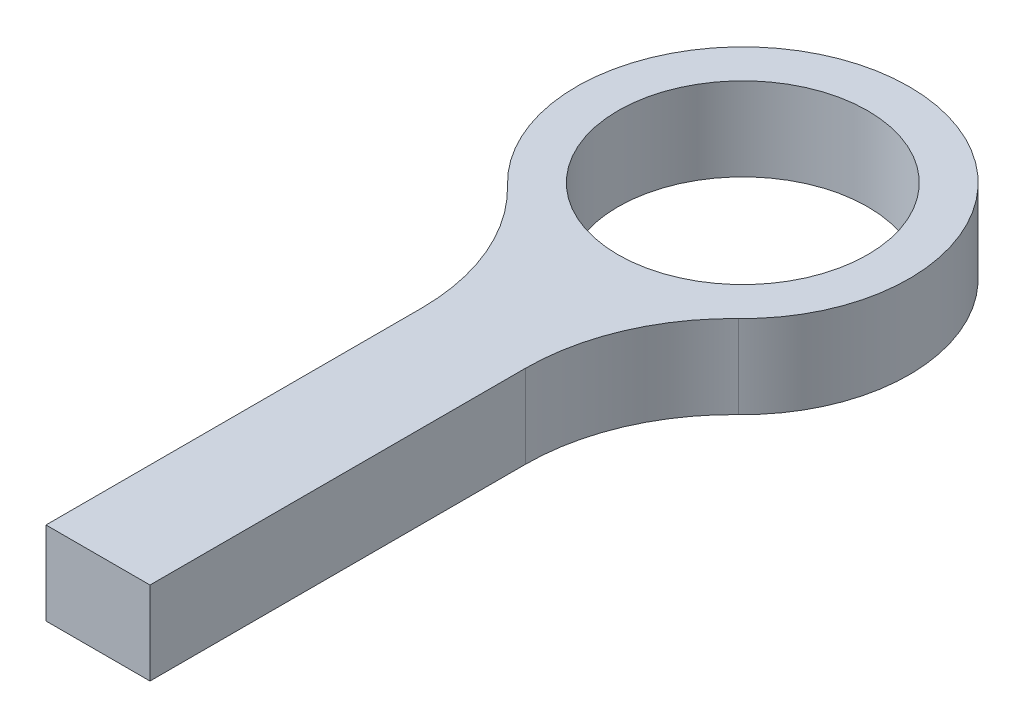
ISO-10303-21;
HEADER;
FILE_DESCRIPTION(('STEP AP214'),'2;1');
FILE_NAME('part.step','',(''),(''),'','','');
FILE_SCHEMA(('AUTOMOTIVE_DESIGN { 1 0 10303 214 1 1 1 1 }'));
ENDSEC;
DATA;
#1=APPLICATION_CONTEXT('core data for automotive mechanical design processes');
#2=APPLICATION_PROTOCOL_DEFINITION('international standard','automotive_design',2000,#1);
#3=PRODUCT_CONTEXT('',#1,'mechanical');
#4=PRODUCT('Part','Part','',(#3));
#5=PRODUCT_RELATED_PRODUCT_CATEGORY('part','',(#4));
#6=PRODUCT_DEFINITION_FORMATION('','',#4);
#7=PRODUCT_DEFINITION_CONTEXT('part definition',#1,'design');
#8=PRODUCT_DEFINITION('design','',#6,#7);
#9=PRODUCT_DEFINITION_SHAPE('','',#8);
#10=(LENGTH_UNIT() NAMED_UNIT(*) SI_UNIT(.MILLI.,.METRE.));
#11=(NAMED_UNIT(*) PLANE_ANGLE_UNIT() SI_UNIT($,.RADIAN.));
#12=(NAMED_UNIT(*) SI_UNIT($,.STERADIAN.) SOLID_ANGLE_UNIT());
#13=UNCERTAINTY_MEASURE_WITH_UNIT(LENGTH_MEASURE(1.E-05),#10,'distance_accuracy_value','');
#14=(GEOMETRIC_REPRESENTATION_CONTEXT(3) GLOBAL_UNCERTAINTY_ASSIGNED_CONTEXT((#13)) GLOBAL_UNIT_ASSIGNED_CONTEXT((#10,
#11,#12)) REPRESENTATION_CONTEXT('',''));
#15=CARTESIAN_POINT('',(0.,0.,0.));
#16=DIRECTION('',(0.,0.,1.));
#17=DIRECTION('',(1.,0.,0.));
#18=AXIS2_PLACEMENT_3D('',#15,#16,#17);
#19=CARTESIAN_POINT('',(-12.5,4.,12.9518338469886));
#20=DIRECTION('',(0.,-1.,0.));
#21=DIRECTION('',(0.,0.,-1.));
#22=AXIS2_PLACEMENT_3D('',#19,#20,#21);
#23=PLANE('',#22);
#24=DIRECTION('',(0.,0.,-1.));
#25=VECTOR('',#24,1.);
#26=CARTESIAN_POINT('',(2.5,4.,12.9518338469886));
#27=LINE('',#26,#25);
#28=CARTESIAN_POINT('',(2.5,4.,31.));
#29=VERTEX_POINT('',#28);
#30=CARTESIAN_POINT('',(2.5,4.,12.9518338469886));
#31=VERTEX_POINT('',#30);
#32=EDGE_CURVE('E128',#29,#31,#27,.T.);
#33=ORIENTED_EDGE('',*,*,#32,.T.);
#34=CARTESIAN_POINT('',(12.5,4.,12.9518338469886));
#35=DIRECTION('',(0.,-1.,0.));
#36=DIRECTION('',(0.,0.,1.));
#37=AXIS2_PLACEMENT_3D('',#34,#35,#36);
#38=CIRCLE('',#37,10.);
#39=CARTESIAN_POINT('',(5.55555555555555,4.,5.75637059866161));
#40=VERTEX_POINT('',#39);
#41=EDGE_CURVE('E86',#31,#40,#38,.T.);
#42=ORIENTED_EDGE('',*,*,#41,.T.);
#43=CARTESIAN_POINT('',(0.,4.,0.));
#44=DIRECTION('',(0.,1.,0.));
#45=DIRECTION('',(0.,0.,1.));
#46=AXIS2_PLACEMENT_3D('',#43,#44,#45);
#47=CIRCLE('',#46,8.);
#48=CARTESIAN_POINT('',(-5.55555555555556,4.,5.75637059866161));
#49=VERTEX_POINT('',#48);
#50=EDGE_CURVE('E99',#40,#49,#47,.T.);
#51=ORIENTED_EDGE('',*,*,#50,.T.);
#52=CARTESIAN_POINT('',(-12.5,4.,12.9518338469886));
#53=DIRECTION('',(0.,-1.,0.));
#54=DIRECTION('',(0.,0.,-1.));
#55=AXIS2_PLACEMENT_3D('',#52,#53,#54);
#56=CIRCLE('',#55,10.);
#57=CARTESIAN_POINT('',(-2.5,4.,12.9518338469886));
#58=VERTEX_POINT('',#57);
#59=EDGE_CURVE('E93',#49,#58,#56,.T.);
#60=ORIENTED_EDGE('',*,*,#59,.T.);
#61=DIRECTION('',(0.,0.,1.));
#62=VECTOR('',#61,1.);
#63=CARTESIAN_POINT('',(-2.5,4.,12.9518338469886));
#64=LINE('',#63,#62);
#65=CARTESIAN_POINT('',(-2.5,4.,31.));
#66=VERTEX_POINT('',#65);
#67=EDGE_CURVE('E97',#58,#66,#64,.T.);
#68=ORIENTED_EDGE('',*,*,#67,.T.);
#69=DIRECTION('',(1.,0.,0.));
#70=VECTOR('',#69,1.);
#71=CARTESIAN_POINT('',(-2.5,4.,31.));
#72=LINE('',#71,#70);
#73=EDGE_CURVE('E49',#66,#29,#72,.T.);
#74=ORIENTED_EDGE('',*,*,#73,.T.);
#75=EDGE_LOOP('',(#33,#42,#51,#60,#68,#74));
#76=FACE_BOUND('',#75,.T.);
#77=CARTESIAN_POINT('',(0.,4.,0.));
#78=DIRECTION('',(0.,1.,0.));
#79=DIRECTION('',(0.,0.,1.));
#80=AXIS2_PLACEMENT_3D('',#77,#78,#79);
#81=CIRCLE('',#80,6.);
#82=CARTESIAN_POINT('',(0.,4.,6.));
#83=VERTEX_POINT('',#82);
#84=EDGE_CURVE('E121',#83,#83,#81,.T.);
#85=ORIENTED_EDGE('',*,*,#84,.F.);
#86=EDGE_LOOP('',(#85));
#87=FACE_BOUND('',#86,.T.);
#88=ADVANCED_FACE('F32',(#76,#87),#23,.F.);
#89=CARTESIAN_POINT('',(-12.5,0.,12.9518338469886));
#90=DIRECTION('',(0.,-1.,0.));
#91=DIRECTION('',(0.,0.,-1.));
#92=AXIS2_PLACEMENT_3D('',#89,#90,#91);
#93=PLANE('',#92);
#94=DIRECTION('',(0.,0.,-1.));
#95=VECTOR('',#94,1.);
#96=CARTESIAN_POINT('',(2.5,0.,12.9518338469886));
#97=LINE('',#96,#95);
#98=CARTESIAN_POINT('',(2.5,0.,31.));
#99=VERTEX_POINT('',#98);
#100=CARTESIAN_POINT('',(2.5,0.,12.9518338469886));
#101=VERTEX_POINT('',#100);
#102=EDGE_CURVE('E117',#99,#101,#97,.T.);
#103=ORIENTED_EDGE('',*,*,#102,.F.);
#104=DIRECTION('',(1.,0.,0.));
#105=VECTOR('',#104,1.);
#106=CARTESIAN_POINT('',(-2.5,0.,31.));
#107=LINE('',#106,#105);
#108=CARTESIAN_POINT('',(-2.5,0.,31.));
#109=VERTEX_POINT('',#108);
#110=EDGE_CURVE('E78',#109,#99,#107,.T.);
#111=ORIENTED_EDGE('',*,*,#110,.F.);
#112=DIRECTION('',(0.,0.,1.));
#113=VECTOR('',#112,1.);
#114=CARTESIAN_POINT('',(-2.5,0.,12.9518338469886));
#115=LINE('',#114,#113);
#116=CARTESIAN_POINT('',(-2.5,0.,12.9518338469886));
#117=VERTEX_POINT('',#116);
#118=EDGE_CURVE('E72',#117,#109,#115,.T.);
#119=ORIENTED_EDGE('',*,*,#118,.F.);
#120=CARTESIAN_POINT('',(-12.5,0.,12.9518338469886));
#121=DIRECTION('',(0.,-1.,0.));
#122=DIRECTION('',(0.,0.,-1.));
#123=AXIS2_PLACEMENT_3D('',#120,#121,#122);
#124=CIRCLE('',#123,10.);
#125=CARTESIAN_POINT('',(-5.55555555555556,0.,5.75637059866161));
#126=VERTEX_POINT('',#125);
#127=EDGE_CURVE('E107',#126,#117,#124,.T.);
#128=ORIENTED_EDGE('',*,*,#127,.F.);
#129=CARTESIAN_POINT('',(0.,0.,0.));
#130=DIRECTION('',(0.,1.,0.));
#131=DIRECTION('',(0.,0.,1.));
#132=AXIS2_PLACEMENT_3D('',#129,#130,#131);
#133=CIRCLE('',#132,8.);
#134=CARTESIAN_POINT('',(5.55555555555555,0.,5.75637059866161));
#135=VERTEX_POINT('',#134);
#136=EDGE_CURVE('E123',#135,#126,#133,.T.);
#137=ORIENTED_EDGE('',*,*,#136,.F.);
#138=CARTESIAN_POINT('',(12.5,0.,12.9518338469886));
#139=DIRECTION('',(0.,-1.,0.));
#140=DIRECTION('',(0.,0.,1.));
#141=AXIS2_PLACEMENT_3D('',#138,#139,#140);
#142=CIRCLE('',#141,10.);
#143=EDGE_CURVE('E120',#101,#135,#142,.T.);
#144=ORIENTED_EDGE('',*,*,#143,.F.);
#145=EDGE_LOOP('',(#103,#111,#119,#128,#137,#144));
#146=FACE_BOUND('',#145,.T.);
#147=CARTESIAN_POINT('',(0.,0.,0.));
#148=DIRECTION('',(0.,1.,0.));
#149=DIRECTION('',(0.,0.,1.));
#150=AXIS2_PLACEMENT_3D('',#147,#148,#149);
#151=CIRCLE('',#150,6.);
#152=CARTESIAN_POINT('',(0.,0.,6.));
#153=VERTEX_POINT('',#152);
#154=EDGE_CURVE('E221',#153,#153,#151,.T.);
#155=ORIENTED_EDGE('',*,*,#154,.T.);
#156=EDGE_LOOP('',(#155));
#157=FACE_BOUND('',#156,.T.);
#158=ADVANCED_FACE('F137',(#146,#157),#93,.T.);
#159=CARTESIAN_POINT('',(2.5,4.,12.9518338469886));
#160=DIRECTION('',(-1.,0.,0.));
#161=DIRECTION('',(0.,0.,1.));
#162=AXIS2_PLACEMENT_3D('',#159,#160,#161);
#163=PLANE('',#162);
#164=ORIENTED_EDGE('',*,*,#102,.T.);
#165=DIRECTION('',(0.,-1.,0.));
#166=VECTOR('',#165,1.);
#167=CARTESIAN_POINT('',(2.5,4.,12.9518338469886));
#168=LINE('',#167,#166);
#169=EDGE_CURVE('E11',#31,#101,#168,.T.);
#170=ORIENTED_EDGE('',*,*,#169,.F.);
#171=ORIENTED_EDGE('',*,*,#32,.F.);
#172=DIRECTION('',(0.,-1.,0.));
#173=VECTOR('',#172,1.);
#174=CARTESIAN_POINT('',(2.5,4.,31.));
#175=LINE('',#174,#173);
#176=EDGE_CURVE('E113',#29,#99,#175,.T.);
#177=ORIENTED_EDGE('',*,*,#176,.T.);
#178=EDGE_LOOP('',(#164,#170,#171,#177));
#179=FACE_BOUND('',#178,.T.);
#180=ADVANCED_FACE('F34',(#179),#163,.F.);
#181=CARTESIAN_POINT('',(12.5,4.,12.9518338469886));
#182=DIRECTION('',(0.,-1.,0.));
#183=DIRECTION('',(0.,0.,-1.));
#184=AXIS2_PLACEMENT_3D('',#181,#182,#183);
#185=CYLINDRICAL_SURFACE('',#184,10.);
#186=ORIENTED_EDGE('',*,*,#143,.T.);
#187=DIRECTION('',(0.,-1.,0.));
#188=VECTOR('',#187,1.);
#189=CARTESIAN_POINT('',(5.55555555555555,4.,5.75637059866161));
#190=LINE('',#189,#188);
#191=EDGE_CURVE('E41',#40,#135,#190,.T.);
#192=ORIENTED_EDGE('',*,*,#191,.F.);
#193=ORIENTED_EDGE('',*,*,#41,.F.);
#194=ORIENTED_EDGE('',*,*,#169,.T.);
#195=EDGE_LOOP('',(#186,#192,#193,#194));
#196=FACE_BOUND('',#195,.T.);
#197=ADVANCED_FACE('F162',(#196),#185,.F.);
#198=CARTESIAN_POINT('',(0.,4.,0.));
#199=DIRECTION('',(0.,-1.,0.));
#200=DIRECTION('',(0.,0.,-1.));
#201=AXIS2_PLACEMENT_3D('',#198,#199,#200);
#202=CYLINDRICAL_SURFACE('',#201,8.);
#203=ORIENTED_EDGE('',*,*,#136,.T.);
#204=DIRECTION('',(0.,-1.,0.));
#205=VECTOR('',#204,1.);
#206=CARTESIAN_POINT('',(-5.55555555555556,4.,5.75637059866161));
#207=LINE('',#206,#205);
#208=EDGE_CURVE('E108',#49,#126,#207,.T.);
#209=ORIENTED_EDGE('',*,*,#208,.F.);
#210=ORIENTED_EDGE('',*,*,#50,.F.);
#211=ORIENTED_EDGE('',*,*,#191,.T.);
#212=EDGE_LOOP('',(#203,#209,#210,#211));
#213=FACE_BOUND('',#212,.T.);
#214=ADVANCED_FACE('F134',(#213),#202,.T.);
#215=CARTESIAN_POINT('',(-12.5,4.,12.9518338469886));
#216=DIRECTION('',(0.,-1.,0.));
#217=DIRECTION('',(0.,0.,-1.));
#218=AXIS2_PLACEMENT_3D('',#215,#216,#217);
#219=CYLINDRICAL_SURFACE('',#218,10.);
#220=ORIENTED_EDGE('',*,*,#127,.T.);
#221=DIRECTION('',(0.,-1.,0.));
#222=VECTOR('',#221,1.);
#223=CARTESIAN_POINT('',(-2.5,4.,12.9518338469886));
#224=LINE('',#223,#222);
#225=EDGE_CURVE('E104',#58,#117,#224,.T.);
#226=ORIENTED_EDGE('',*,*,#225,.F.);
#227=ORIENTED_EDGE('',*,*,#59,.F.);
#228=ORIENTED_EDGE('',*,*,#208,.T.);
#229=EDGE_LOOP('',(#220,#226,#227,#228));
#230=FACE_BOUND('',#229,.T.);
#231=ADVANCED_FACE('F105',(#230),#219,.F.);
#232=CARTESIAN_POINT('',(-2.5,4.,12.9518338469886));
#233=DIRECTION('',(1.,0.,0.));
#234=DIRECTION('',(0.,0.,-1.));
#235=AXIS2_PLACEMENT_3D('',#232,#233,#234);
#236=PLANE('',#235);
#237=ORIENTED_EDGE('',*,*,#118,.T.);
#238=DIRECTION('',(0.,-1.,0.));
#239=VECTOR('',#238,1.);
#240=CARTESIAN_POINT('',(-2.5,4.,31.));
#241=LINE('',#240,#239);
#242=EDGE_CURVE('E109',#66,#109,#241,.T.);
#243=ORIENTED_EDGE('',*,*,#242,.F.);
#244=ORIENTED_EDGE('',*,*,#67,.F.);
#245=ORIENTED_EDGE('',*,*,#225,.T.);
#246=EDGE_LOOP('',(#237,#243,#244,#245));
#247=FACE_BOUND('',#246,.T.);
#248=ADVANCED_FACE('F111',(#247),#236,.F.);
#249=CARTESIAN_POINT('',(-2.5,4.,31.));
#250=DIRECTION('',(0.,0.,-1.));
#251=DIRECTION('',(-1.,0.,0.));
#252=AXIS2_PLACEMENT_3D('',#249,#250,#251);
#253=PLANE('',#252);
#254=ORIENTED_EDGE('',*,*,#110,.T.);
#255=ORIENTED_EDGE('',*,*,#176,.F.);
#256=ORIENTED_EDGE('',*,*,#73,.F.);
#257=ORIENTED_EDGE('',*,*,#242,.T.);
#258=EDGE_LOOP('',(#254,#255,#256,#257));
#259=FACE_BOUND('',#258,.T.);
#260=ADVANCED_FACE('F142',(#259),#253,.F.);
#261=CARTESIAN_POINT('',(0.,4.,0.));
#262=DIRECTION('',(0.,-1.,0.));
#263=DIRECTION('',(0.,0.,-1.));
#264=AXIS2_PLACEMENT_3D('',#261,#262,#263);
#265=CYLINDRICAL_SURFACE('',#264,6.);
#266=ORIENTED_EDGE('',*,*,#84,.T.);
#267=EDGE_LOOP('',(#266));
#268=FACE_BOUND('',#267,.T.);
#269=ORIENTED_EDGE('',*,*,#154,.F.);
#270=EDGE_LOOP('',(#269));
#271=FACE_BOUND('',#270,.T.);
#272=ADVANCED_FACE('F144',(#268,#271),#265,.F.);
#273=CLOSED_SHELL('',(#88,#158,#180,#197,#214,#231,#248,#260,#272));
#274=MANIFOLD_SOLID_BREP('B2',#273);
#275=ADVANCED_BREP_SHAPE_REPRESENTATION('',(#18,#274),#14);
#276=SHAPE_DEFINITION_REPRESENTATION(#9,#275);
ENDSEC;
END-ISO-10303-21;
